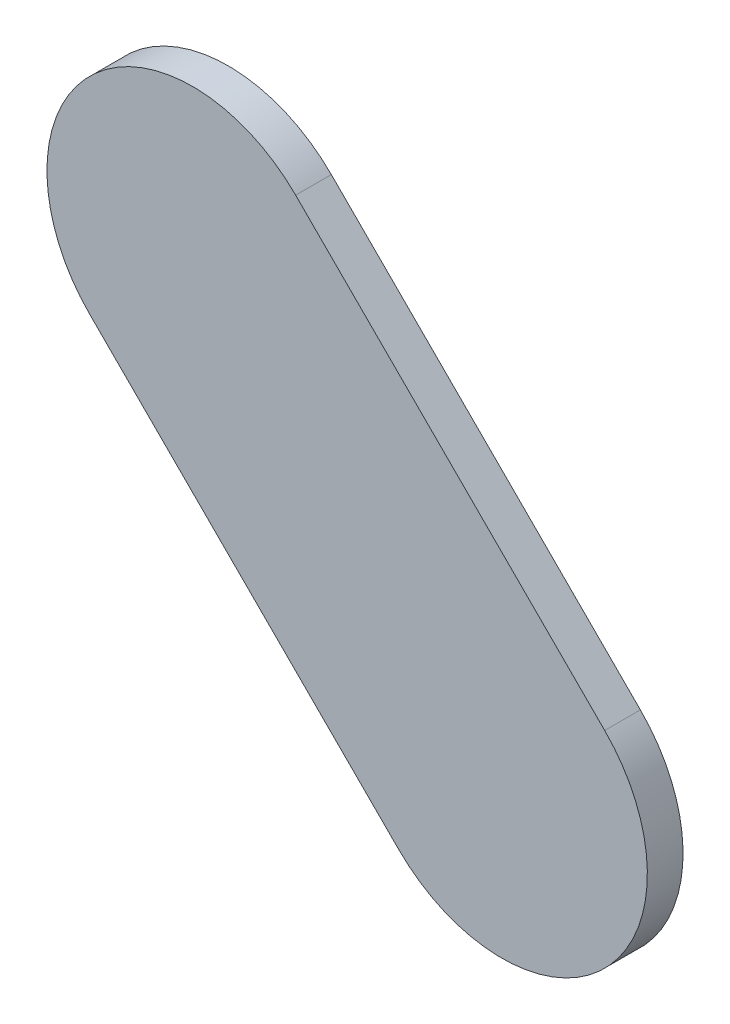
ISO-10303-21;
HEADER;
FILE_DESCRIPTION(('STEP AP214'),'2;1');
FILE_NAME('part.step','',(''),(''),'','','');
FILE_SCHEMA(('AUTOMOTIVE_DESIGN { 1 0 10303 214 1 1 1 1 }'));
ENDSEC;
DATA;
#1=APPLICATION_CONTEXT('core data for automotive mechanical design processes');
#2=APPLICATION_PROTOCOL_DEFINITION('international standard','automotive_design',2000,#1);
#3=PRODUCT_CONTEXT('',#1,'mechanical');
#4=PRODUCT('Part','Part','',(#3));
#5=PRODUCT_RELATED_PRODUCT_CATEGORY('part','',(#4));
#6=PRODUCT_DEFINITION_FORMATION('','',#4);
#7=PRODUCT_DEFINITION_CONTEXT('part definition',#1,'design');
#8=PRODUCT_DEFINITION('design','',#6,#7);
#9=PRODUCT_DEFINITION_SHAPE('','',#8);
#10=(LENGTH_UNIT() NAMED_UNIT(*) SI_UNIT(.MILLI.,.METRE.));
#11=(NAMED_UNIT(*) PLANE_ANGLE_UNIT() SI_UNIT($,.RADIAN.));
#12=(NAMED_UNIT(*) SI_UNIT($,.STERADIAN.) SOLID_ANGLE_UNIT());
#13=UNCERTAINTY_MEASURE_WITH_UNIT(LENGTH_MEASURE(1.E-05),#10,'distance_accuracy_value','');
#14=(GEOMETRIC_REPRESENTATION_CONTEXT(3) GLOBAL_UNCERTAINTY_ASSIGNED_CONTEXT((#13)) GLOBAL_UNIT_ASSIGNED_CONTEXT((#10,
#11,#12)) REPRESENTATION_CONTEXT('',''));
#15=CARTESIAN_POINT('',(0.,0.,0.));
#16=DIRECTION('',(0.,0.,1.));
#17=DIRECTION('',(1.,0.,0.));
#18=AXIS2_PLACEMENT_3D('',#15,#16,#17);
#19=CARTESIAN_POINT('',(6.837198332428,3.153108039131,0.79916));
#20=DIRECTION('',(0.,0.,1.));
#21=DIRECTION('',(1.,0.,0.));
#22=AXIS2_PLACEMENT_3D('',#19,#20,#21);
#23=PLANE('',#22);
#24=CARTESIAN_POINT('',(6.688812333,3.300974434268,0.79916));
#25=DIRECTION('',(0.,0.,1.));
#26=DIRECTION('',(1.,0.,0.));
#27=AXIS2_PLACEMENT_3D('',#24,#25,#26);
#28=CIRCLE('',#27,0.140000472348);
#29=CARTESIAN_POINT('',(6.58981722183352,3.20197944416646,0.79916));
#30=VERTEX_POINT('',#29);
#31=CARTESIAN_POINT('',(6.78780769726737,3.39996963673356,0.79916));
#32=VERTEX_POINT('',#31);
#33=EDGE_CURVE('E20',#30,#32,#28,.F.);
#34=ORIENTED_EDGE('',*,*,#33,.F.);
#35=DIRECTION('',(-0.707107575236102,0.707105987136102,0.));
#36=VECTOR('',#35,1.);
#37=CARTESIAN_POINT('',(6.886802333001,2.904995000001,0.79916));
#38=LINE('',#37,#36);
#39=CARTESIAN_POINT('',(6.88680241390159,2.90499491910059,0.79916));
#40=VERTEX_POINT('',#39);
#41=EDGE_CURVE('E65',#30,#40,#38,.F.);
#42=ORIENTED_EDGE('',*,*,#41,.T.);
#43=CARTESIAN_POINT('',(6.985797333,3.003989333,0.79916));
#44=DIRECTION('',(0.,0.,1.));
#45=DIRECTION('',(1.,0.,0.));
#46=AXIS2_PLACEMENT_3D('',#43,#44,#45);
#47=CIRCLE('',#46,0.140000072315);
#48=CARTESIAN_POINT('',(7.08479222233319,3.1029844446662,0.79916));
#49=VERTEX_POINT('',#48);
#50=EDGE_CURVE('E57',#49,#40,#47,.F.);
#51=ORIENTED_EDGE('',*,*,#50,.F.);
#52=DIRECTION('',(0.707105987136602,-0.707107575235602,0.));
#53=VECTOR('',#52,1.);
#54=CARTESIAN_POINT('',(6.787807667001,3.399969667,0.79916));
#55=LINE('',#54,#53);
#56=EDGE_CURVE('E64',#49,#32,#55,.F.);
#57=ORIENTED_EDGE('',*,*,#56,.T.);
#58=EDGE_LOOP('',(#34,#42,#51,#57));
#59=FACE_BOUND('',#58,.T.);
#60=ADVANCED_FACE('F17',(#59),#23,.T.);
#61=CARTESIAN_POINT('',(6.886802333001,2.904995000001,0.76487));
#62=DIRECTION('',(0.707105987136102,0.707107575236102,0.));
#63=DIRECTION('',(-0.707107575236102,0.707105987136102,0.));
#64=AXIS2_PLACEMENT_3D('',#61,#62,#63);
#65=PLANE('',#64);
#66=DIRECTION('',(0.,0.,1.));
#67=VECTOR('',#66,1.);
#68=CARTESIAN_POINT('',(6.58981733300002,3.20197933300002,0.76487));
#69=LINE('',#68,#67);
#70=CARTESIAN_POINT('',(6.58981722183345,3.20197944416632,0.76487));
#71=VERTEX_POINT('',#70);
#72=EDGE_CURVE('E68',#71,#30,#69,.T.);
#73=ORIENTED_EDGE('',*,*,#72,.F.);
#74=DIRECTION('',(-0.707107575236588,0.707105987135616,0.));
#75=VECTOR('',#74,1.);
#76=CARTESIAN_POINT('',(6.886802333001,2.904995000001,0.76487));
#77=LINE('',#76,#75);
#78=CARTESIAN_POINT('',(6.88680241390163,2.90499491910056,0.76487));
#79=VERTEX_POINT('',#78);
#80=EDGE_CURVE('E72',#79,#71,#77,.T.);
#81=ORIENTED_EDGE('',*,*,#80,.F.);
#82=DIRECTION('',(0.,0.,1.));
#83=VECTOR('',#82,1.);
#84=CARTESIAN_POINT('',(6.886802333001,2.904995000001,0.76487));
#85=LINE('',#84,#83);
#86=EDGE_CURVE('E60',#40,#79,#85,.F.);
#87=ORIENTED_EDGE('',*,*,#86,.F.);
#88=ORIENTED_EDGE('',*,*,#41,.F.);
#89=EDGE_LOOP('',(#73,#81,#87,#88));
#90=FACE_BOUND('',#89,.T.);
#91=ADVANCED_FACE('F70',(#90),#65,.F.);
#92=CARTESIAN_POINT('',(6.688812333,3.300974434268,0.76487));
#93=DIRECTION('',(0.,0.,1.));
#94=DIRECTION('',(1.,0.,0.));
#95=AXIS2_PLACEMENT_3D('',#92,#93,#94);
#96=CYLINDRICAL_SURFACE('',#95,0.140000472348);
#97=DIRECTION('',(0.,0.,1.));
#98=VECTOR('',#97,1.);
#99=CARTESIAN_POINT('',(6.787807667001,3.399969667,0.76487));
#100=LINE('',#99,#98);
#101=CARTESIAN_POINT('',(6.78780769726735,3.39996963673358,0.76487));
#102=VERTEX_POINT('',#101);
#103=EDGE_CURVE('E77',#32,#102,#100,.F.);
#104=ORIENTED_EDGE('',*,*,#103,.T.);
#105=CARTESIAN_POINT('',(6.688812,3.300974667,0.76487));
#106=DIRECTION('',(0.,0.,1.));
#107=DIRECTION('',(1.,0.,0.));
#108=AXIS2_PLACEMENT_3D('',#105,#106,#107);
#109=CIRCLE('',#108,0.140000072315);
#110=EDGE_CURVE('E26',#71,#102,#109,.F.);
#111=ORIENTED_EDGE('',*,*,#110,.F.);
#112=ORIENTED_EDGE('',*,*,#72,.T.);
#113=ORIENTED_EDGE('',*,*,#33,.T.);
#114=EDGE_LOOP('',(#104,#111,#112,#113));
#115=FACE_BOUND('',#114,.T.);
#116=ADVANCED_FACE('F88',(#115),#96,.T.);
#117=CARTESIAN_POINT('',(6.787807667001,3.399969667,0.76487));
#118=DIRECTION('',(-0.707107575235602,-0.707105987136602,0.));
#119=DIRECTION('',(0.707105987136602,-0.707107575235602,0.));
#120=AXIS2_PLACEMENT_3D('',#117,#118,#119);
#121=PLANE('',#120);
#122=DIRECTION('',(0.,0.,1.));
#123=VECTOR('',#122,1.);
#124=CARTESIAN_POINT('',(7.08479199999998,3.10298466699998,0.76487));
#125=LINE('',#124,#123);
#126=CARTESIAN_POINT('',(7.08479222233322,3.10298444466627,0.76487));
#127=VERTEX_POINT('',#126);
#128=EDGE_CURVE('E62',#127,#49,#125,.T.);
#129=ORIENTED_EDGE('',*,*,#128,.F.);
#130=DIRECTION('',(0.707105987136807,-0.707107575235397,0.));
#131=VECTOR('',#130,1.);
#132=CARTESIAN_POINT('',(6.787807667001,3.399969667,0.76487));
#133=LINE('',#132,#131);
#134=EDGE_CURVE('E11',#102,#127,#133,.T.);
#135=ORIENTED_EDGE('',*,*,#134,.F.);
#136=ORIENTED_EDGE('',*,*,#103,.F.);
#137=ORIENTED_EDGE('',*,*,#56,.F.);
#138=EDGE_LOOP('',(#129,#135,#136,#137));
#139=FACE_BOUND('',#138,.T.);
#140=ADVANCED_FACE('F96',(#139),#121,.F.);
#141=CARTESIAN_POINT('',(6.985797333,3.003989333,0.76487));
#142=DIRECTION('',(0.,0.,1.));
#143=DIRECTION('',(1.,0.,0.));
#144=AXIS2_PLACEMENT_3D('',#141,#142,#143);
#145=CYLINDRICAL_SURFACE('',#144,0.140000072315);
#146=CARTESIAN_POINT('',(6.985797333001,3.003989898733,0.76487));
#147=DIRECTION('',(0.,0.,1.));
#148=DIRECTION('',(1.,0.,0.));
#149=AXIS2_PLACEMENT_3D('',#146,#147,#148);
#150=CIRCLE('',#149,0.14);
#151=EDGE_CURVE('E35',#127,#79,#150,.F.);
#152=ORIENTED_EDGE('',*,*,#151,.F.);
#153=ORIENTED_EDGE('',*,*,#128,.T.);
#154=ORIENTED_EDGE('',*,*,#50,.T.);
#155=ORIENTED_EDGE('',*,*,#86,.T.);
#156=EDGE_LOOP('',(#152,#153,#154,#155));
#157=FACE_BOUND('',#156,.T.);
#158=ADVANCED_FACE('F58',(#157),#145,.T.);
#159=CARTESIAN_POINT('',(6.837198332428,3.153108039131,0.76487));
#160=DIRECTION('',(0.,0.,-1.));
#161=DIRECTION('',(-1.,0.,0.));
#162=AXIS2_PLACEMENT_3D('',#159,#160,#161);
#163=PLANE('',#162);
#164=ORIENTED_EDGE('',*,*,#134,.T.);
#165=ORIENTED_EDGE('',*,*,#151,.T.);
#166=ORIENTED_EDGE('',*,*,#80,.T.);
#167=ORIENTED_EDGE('',*,*,#110,.T.);
#168=EDGE_LOOP('',(#164,#165,#166,#167));
#169=FACE_BOUND('',#168,.T.);
#170=ADVANCED_FACE('F89',(#169),#163,.T.);
#171=CLOSED_SHELL('',(#60,#91,#116,#140,#158,#170));
#172=MANIFOLD_SOLID_BREP('B1',#171);
#173=ADVANCED_BREP_SHAPE_REPRESENTATION('',(#18,#172),#14);
#174=SHAPE_DEFINITION_REPRESENTATION(#9,#173);
ENDSEC;
END-ISO-10303-21;
